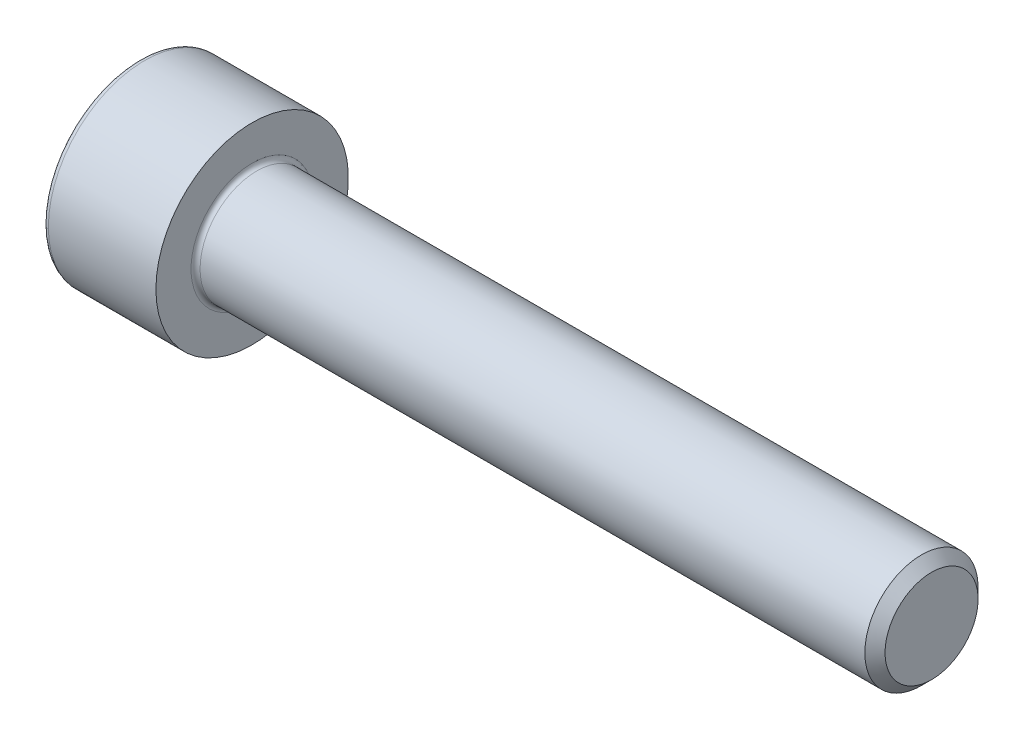
ISO-10303-21;
HEADER;
FILE_DESCRIPTION(('STEP AP214'),'2;1');
FILE_NAME('part.step','',(''),(''),'','','');
FILE_SCHEMA(('AUTOMOTIVE_DESIGN { 1 0 10303 214 1 1 1 1 }'));
ENDSEC;
DATA;
#1=APPLICATION_CONTEXT('core data for automotive mechanical design processes');
#2=APPLICATION_PROTOCOL_DEFINITION('international standard','automotive_design',2000,#1);
#3=PRODUCT_CONTEXT('',#1,'mechanical');
#4=PRODUCT('Part','Part','',(#3));
#5=PRODUCT_RELATED_PRODUCT_CATEGORY('part','',(#4));
#6=PRODUCT_DEFINITION_FORMATION('','',#4);
#7=PRODUCT_DEFINITION_CONTEXT('part definition',#1,'design');
#8=PRODUCT_DEFINITION('design','',#6,#7);
#9=PRODUCT_DEFINITION_SHAPE('','',#8);
#10=(LENGTH_UNIT() NAMED_UNIT(*) SI_UNIT(.MILLI.,.METRE.));
#11=(NAMED_UNIT(*) PLANE_ANGLE_UNIT() SI_UNIT($,.RADIAN.));
#12=(NAMED_UNIT(*) SI_UNIT($,.STERADIAN.) SOLID_ANGLE_UNIT());
#13=UNCERTAINTY_MEASURE_WITH_UNIT(LENGTH_MEASURE(1.E-05),#10,'distance_accuracy_value','');
#14=(GEOMETRIC_REPRESENTATION_CONTEXT(3) GLOBAL_UNCERTAINTY_ASSIGNED_CONTEXT((#13)) GLOBAL_UNIT_ASSIGNED_CONTEXT((#10,
#11,#12)) REPRESENTATION_CONTEXT('',''));
#15=CARTESIAN_POINT('',(0.,0.,0.));
#16=DIRECTION('',(0.,0.,1.));
#17=DIRECTION('',(1.,0.,0.));
#18=AXIS2_PLACEMENT_3D('',#15,#16,#17);
#19=CARTESIAN_POINT('',(0.,0.,0.));
#20=DIRECTION('',(-1.,0.,0.));
#21=DIRECTION('',(0.,0.,1.));
#22=AXIS2_PLACEMENT_3D('',#19,#20,#21);
#23=PLANE('',#22);
#24=DIRECTION('',(0.,-0.499999999999999,0.866025403784439));
#25=VECTOR('',#24,1.);
#26=CARTESIAN_POINT('',(0.,2.35789849937043,0.));
#27=LINE('',#26,#25);
#28=CARTESIAN_POINT('',(0.,2.35789849937043,0.));
#29=VERTEX_POINT('',#28);
#30=CARTESIAN_POINT('',(0.,1.17894924968522,2.042));
#31=VERTEX_POINT('',#30);
#32=EDGE_CURVE('E269',#29,#31,#27,.T.);
#33=ORIENTED_EDGE('',*,*,#32,.T.);
#34=DIRECTION('',(0.,1.,0.));
#35=VECTOR('',#34,1.);
#36=CARTESIAN_POINT('',(0.,-1.17894924968521,2.042));
#37=LINE('',#36,#35);
#38=CARTESIAN_POINT('',(0.,-1.17894924968521,2.042));
#39=VERTEX_POINT('',#38);
#40=EDGE_CURVE('E141',#39,#31,#37,.T.);
#41=ORIENTED_EDGE('',*,*,#40,.F.);
#42=DIRECTION('',(0.,-0.500000000000001,-0.866025403784438));
#43=VECTOR('',#42,1.);
#44=CARTESIAN_POINT('',(0.,-1.17894924968521,2.042));
#45=LINE('',#44,#43);
#46=CARTESIAN_POINT('',(0.,-2.35789849937043,0.));
#47=VERTEX_POINT('',#46);
#48=EDGE_CURVE('E272',#39,#47,#45,.T.);
#49=ORIENTED_EDGE('',*,*,#48,.T.);
#50=DIRECTION('',(0.,0.499999999999998,-0.86602540378444));
#51=VECTOR('',#50,1.);
#52=CARTESIAN_POINT('',(0.,-2.35789849937043,0.));
#53=LINE('',#52,#51);
#54=CARTESIAN_POINT('',(0.,-1.17894924968522,-2.042));
#55=VERTEX_POINT('',#54);
#56=EDGE_CURVE('E275',#47,#55,#53,.T.);
#57=ORIENTED_EDGE('',*,*,#56,.T.);
#58=DIRECTION('',(0.,-1.,0.));
#59=VECTOR('',#58,1.);
#60=CARTESIAN_POINT('',(0.,1.17894924968521,-2.042));
#61=LINE('',#60,#59);
#62=CARTESIAN_POINT('',(0.,1.17894924968521,-2.042));
#63=VERTEX_POINT('',#62);
#64=EDGE_CURVE('E278',#63,#55,#61,.T.);
#65=ORIENTED_EDGE('',*,*,#64,.F.);
#66=DIRECTION('',(0.,-0.500000000000001,-0.866025403784438));
#67=VECTOR('',#66,1.);
#68=CARTESIAN_POINT('',(0.,2.35789849937043,0.));
#69=LINE('',#68,#67);
#70=EDGE_CURVE('E136',#29,#63,#69,.T.);
#71=ORIENTED_EDGE('',*,*,#70,.F.);
#72=EDGE_LOOP('',(#33,#41,#49,#57,#65,#71));
#73=FACE_BOUND('',#72,.T.);
#74=CARTESIAN_POINT('',(0.,0.,0.));
#75=DIRECTION('',(-1.,0.,0.));
#76=DIRECTION('',(0.,0.,1.));
#77=AXIS2_PLACEMENT_3D('',#74,#75,#76);
#78=CIRCLE('',#77,4.);
#79=CARTESIAN_POINT('',(0.,0.,4.));
#80=VERTEX_POINT('',#79);
#81=EDGE_CURVE('E53',#80,#80,#78,.T.);
#82=ORIENTED_EDGE('',*,*,#81,.T.);
#83=EDGE_LOOP('',(#82));
#84=FACE_BOUND('',#83,.T.);
#85=ADVANCED_FACE('F45',(#73,#84),#23,.T.);
#86=CARTESIAN_POINT('',(-31.75,0.,0.));
#87=DIRECTION('',(-1.,0.,0.));
#88=DIRECTION('',(0.,0.,1.));
#89=AXIS2_PLACEMENT_3D('',#86,#87,#88);
#90=CYLINDRICAL_SURFACE('',#89,4.25);
#91=CARTESIAN_POINT('',(0.25,0.,0.));
#92=DIRECTION('',(-1.,0.,0.));
#93=DIRECTION('',(0.,0.,1.));
#94=AXIS2_PLACEMENT_3D('',#91,#92,#93);
#95=CIRCLE('',#94,4.25);
#96=CARTESIAN_POINT('',(0.25,0.,4.25));
#97=VERTEX_POINT('',#96);
#98=EDGE_CURVE('E11',#97,#97,#95,.F.);
#99=ORIENTED_EDGE('',*,*,#98,.T.);
#100=EDGE_LOOP('',(#99));
#101=FACE_BOUND('',#100,.T.);
#102=CARTESIAN_POINT('',(5.,0.,0.));
#103=DIRECTION('',(-1.,0.,0.));
#104=DIRECTION('',(0.,0.,1.));
#105=AXIS2_PLACEMENT_3D('',#102,#103,#104);
#106=CIRCLE('',#105,4.25);
#107=CARTESIAN_POINT('',(5.,0.,4.25));
#108=VERTEX_POINT('',#107);
#109=EDGE_CURVE('E159',#108,#108,#106,.T.);
#110=ORIENTED_EDGE('',*,*,#109,.T.);
#111=EDGE_LOOP('',(#110));
#112=FACE_BOUND('',#111,.T.);
#113=ADVANCED_FACE('F184',(#101,#112),#90,.T.);
#114=CARTESIAN_POINT('',(5.,4.25,0.));
#115=DIRECTION('',(1.,0.,0.));
#116=DIRECTION('',(0.,0.,-1.));
#117=AXIS2_PLACEMENT_3D('',#114,#115,#116);
#118=PLANE('',#117);
#119=CARTESIAN_POINT('',(5.,0.,0.));
#120=DIRECTION('',(1.,0.,0.));
#121=DIRECTION('',(0.,0.,-1.));
#122=AXIS2_PLACEMENT_3D('',#119,#120,#121);
#123=CIRCLE('',#122,2.7);
#124=CARTESIAN_POINT('',(5.,0.,-2.7));
#125=VERTEX_POINT('',#124);
#126=EDGE_CURVE('E162',#125,#125,#123,.F.);
#127=ORIENTED_EDGE('',*,*,#126,.T.);
#128=EDGE_LOOP('',(#127));
#129=FACE_BOUND('',#128,.T.);
#130=ORIENTED_EDGE('',*,*,#109,.F.);
#131=EDGE_LOOP('',(#130));
#132=FACE_BOUND('',#131,.T.);
#133=ADVANCED_FACE('F189',(#129,#132),#118,.T.);
#134=CARTESIAN_POINT('',(-31.75,0.,0.));
#135=DIRECTION('',(-1.,0.,0.));
#136=DIRECTION('',(0.,0.,1.));
#137=AXIS2_PLACEMENT_3D('',#134,#135,#136);
#138=CYLINDRICAL_SURFACE('',#137,2.5);
#139=CARTESIAN_POINT('',(5.2,0.,0.));
#140=DIRECTION('',(1.,0.,0.));
#141=DIRECTION('',(0.,0.,-1.));
#142=AXIS2_PLACEMENT_3D('',#139,#140,#141);
#143=CIRCLE('',#142,2.5);
#144=CARTESIAN_POINT('',(5.2,0.,-2.5));
#145=VERTEX_POINT('',#144);
#146=EDGE_CURVE('E165',#145,#145,#143,.T.);
#147=ORIENTED_EDGE('',*,*,#146,.T.);
#148=EDGE_LOOP('',(#147));
#149=FACE_BOUND('',#148,.T.);
#150=CARTESIAN_POINT('',(34.555,0.,0.));
#151=DIRECTION('',(-1.,0.,0.));
#152=DIRECTION('',(0.,0.,1.));
#153=AXIS2_PLACEMENT_3D('',#150,#151,#152);
#154=CIRCLE('',#153,2.5);
#155=CARTESIAN_POINT('',(34.555,0.,2.5));
#156=VERTEX_POINT('',#155);
#157=EDGE_CURVE('E156',#156,#156,#154,.T.);
#158=ORIENTED_EDGE('',*,*,#157,.T.);
#159=EDGE_LOOP('',(#158));
#160=FACE_BOUND('',#159,.T.);
#161=ADVANCED_FACE('F195',(#149,#160),#138,.T.);
#162=CARTESIAN_POINT('',(35.,0.,0.));
#163=DIRECTION('',(-1.,0.,0.));
#164=DIRECTION('',(0.,0.,1.));
#165=AXIS2_PLACEMENT_3D('',#162,#163,#164);
#166=CONICAL_SURFACE('',#165,2.055,0.785398163397479);
#167=ORIENTED_EDGE('',*,*,#157,.F.);
#168=EDGE_LOOP('',(#167));
#169=FACE_BOUND('',#168,.T.);
#170=CARTESIAN_POINT('',(35.,0.,0.));
#171=DIRECTION('',(-1.,0.,0.));
#172=DIRECTION('',(0.,0.,1.));
#173=AXIS2_PLACEMENT_3D('',#170,#171,#172);
#174=CIRCLE('',#173,2.055);
#175=CARTESIAN_POINT('',(35.,0.,2.055));
#176=VERTEX_POINT('',#175);
#177=EDGE_CURVE('E152',#176,#176,#174,.T.);
#178=ORIENTED_EDGE('',*,*,#177,.T.);
#179=EDGE_LOOP('',(#178));
#180=FACE_BOUND('',#179,.T.);
#181=ADVANCED_FACE('F199',(#169,#180),#166,.T.);
#182=CARTESIAN_POINT('',(35.,2.055,0.));
#183=DIRECTION('',(1.,0.,0.));
#184=DIRECTION('',(0.,0.,-1.));
#185=AXIS2_PLACEMENT_3D('',#182,#183,#184);
#186=PLANE('',#185);
#187=ORIENTED_EDGE('',*,*,#177,.F.);
#188=EDGE_LOOP('',(#187));
#189=FACE_BOUND('',#188,.T.);
#190=ADVANCED_FACE('F181',(#189),#186,.T.);
#191=CARTESIAN_POINT('',(5.2,0.,0.));
#192=DIRECTION('',(1.,0.,0.));
#193=DIRECTION('',(0.,0.,-1.));
#194=AXIS2_PLACEMENT_3D('',#191,#192,#193);
#195=TOROIDAL_SURFACE('',#194,2.7,0.2);
#196=ORIENTED_EDGE('',*,*,#146,.F.);
#197=EDGE_LOOP('',(#196));
#198=FACE_BOUND('',#197,.T.);
#199=ORIENTED_EDGE('',*,*,#126,.F.);
#200=EDGE_LOOP('',(#199));
#201=FACE_BOUND('',#200,.T.);
#202=ADVANCED_FACE('F172',(#198,#201),#195,.F.);
#203=CARTESIAN_POINT('',(0.25,0.,0.));
#204=DIRECTION('',(-1.,0.,0.));
#205=DIRECTION('',(0.,0.,1.));
#206=AXIS2_PLACEMENT_3D('',#203,#204,#205);
#207=TOROIDAL_SURFACE('',#206,4.,0.25);
#208=ORIENTED_EDGE('',*,*,#98,.F.);
#209=EDGE_LOOP('',(#208));
#210=FACE_BOUND('',#209,.T.);
#211=ORIENTED_EDGE('',*,*,#81,.F.);
#212=EDGE_LOOP('',(#211));
#213=FACE_BOUND('',#212,.T.);
#214=ADVANCED_FACE('F47',(#210,#213),#207,.T.);
#215=CARTESIAN_POINT('',(2.5,2.35789849937043,0.));
#216=DIRECTION('',(0.,-0.866025403784439,-0.499999999999999));
#217=DIRECTION('',(0.,0.499999999999999,-0.866025403784439));
#218=AXIS2_PLACEMENT_3D('',#215,#216,#217);
#219=PLANE('',#218);
#220=ORIENTED_EDGE('',*,*,#32,.F.);
#221=DIRECTION('',(-1.,0.,0.));
#222=VECTOR('',#221,1.);
#223=CARTESIAN_POINT('',(2.5,2.35789849937043,0.));
#224=LINE('',#223,#222);
#225=CARTESIAN_POINT('',(2.5,2.35789849937043,0.));
#226=VERTEX_POINT('',#225);
#227=EDGE_CURVE('E259',#226,#29,#224,.T.);
#228=ORIENTED_EDGE('',*,*,#227,.F.);
#229=DIRECTION('',(0.,-0.499999999999999,0.866025403784439));
#230=VECTOR('',#229,1.);
#231=CARTESIAN_POINT('',(2.5,2.35789849937043,0.));
#232=LINE('',#231,#230);
#233=CARTESIAN_POINT('',(2.5,1.76842387452783,1.021));
#234=VERTEX_POINT('',#233);
#235=EDGE_CURVE('E128',#226,#234,#232,.T.);
#236=ORIENTED_EDGE('',*,*,#235,.T.);
#237=CARTESIAN_POINT('',(2.5,1.17894924968522,2.042));
#238=VERTEX_POINT('',#237);
#239=EDGE_CURVE('E119',#234,#238,#232,.T.);
#240=ORIENTED_EDGE('',*,*,#239,.T.);
#241=DIRECTION('',(-1.,0.,0.));
#242=VECTOR('',#241,1.);
#243=CARTESIAN_POINT('',(2.5,1.17894924968522,2.042));
#244=LINE('',#243,#242);
#245=EDGE_CURVE('E133',#238,#31,#244,.T.);
#246=ORIENTED_EDGE('',*,*,#245,.T.);
#247=EDGE_LOOP('',(#220,#228,#236,#240,#246));
#248=FACE_BOUND('',#247,.T.);
#249=ADVANCED_FACE('F132',(#248),#219,.T.);
#250=CARTESIAN_POINT('',(2.5,-1.17894924968521,2.042));
#251=DIRECTION('',(0.,0.,1.));
#252=DIRECTION('',(0.,-1.,0.));
#253=AXIS2_PLACEMENT_3D('',#250,#251,#252);
#254=PLANE('',#253);
#255=ORIENTED_EDGE('',*,*,#40,.T.);
#256=ORIENTED_EDGE('',*,*,#245,.F.);
#257=DIRECTION('',(0.,1.,0.));
#258=VECTOR('',#257,1.);
#259=CARTESIAN_POINT('',(2.5,-1.17894924968521,2.042));
#260=LINE('',#259,#258);
#261=CARTESIAN_POINT('',(2.5,0.,2.042));
#262=VERTEX_POINT('',#261);
#263=EDGE_CURVE('E116',#262,#238,#260,.T.);
#264=ORIENTED_EDGE('',*,*,#263,.F.);
#265=CARTESIAN_POINT('',(2.5,-1.17894924968521,2.042));
#266=VERTEX_POINT('',#265);
#267=EDGE_CURVE('E127',#266,#262,#260,.T.);
#268=ORIENTED_EDGE('',*,*,#267,.F.);
#269=DIRECTION('',(-1.,0.,0.));
#270=VECTOR('',#269,1.);
#271=CARTESIAN_POINT('',(2.5,-1.17894924968521,2.042));
#272=LINE('',#271,#270);
#273=EDGE_CURVE('E143',#266,#39,#272,.T.);
#274=ORIENTED_EDGE('',*,*,#273,.T.);
#275=EDGE_LOOP('',(#255,#256,#264,#268,#274));
#276=FACE_BOUND('',#275,.T.);
#277=ADVANCED_FACE('F138',(#276),#254,.F.);
#278=CARTESIAN_POINT('',(2.5,-1.17894924968521,2.042));
#279=DIRECTION('',(0.,0.866025403784438,-0.500000000000001));
#280=DIRECTION('',(0.,0.500000000000001,0.866025403784438));
#281=AXIS2_PLACEMENT_3D('',#278,#279,#280);
#282=PLANE('',#281);
#283=ORIENTED_EDGE('',*,*,#48,.F.);
#284=ORIENTED_EDGE('',*,*,#273,.F.);
#285=DIRECTION('',(0.,-0.500000000000001,-0.866025403784438));
#286=VECTOR('',#285,1.);
#287=CARTESIAN_POINT('',(2.5,-1.17894924968521,2.042));
#288=LINE('',#287,#286);
#289=CARTESIAN_POINT('',(2.5,-1.76842387452782,1.021));
#290=VERTEX_POINT('',#289);
#291=EDGE_CURVE('E298',#266,#290,#288,.T.);
#292=ORIENTED_EDGE('',*,*,#291,.T.);
#293=CARTESIAN_POINT('',(2.5,-2.35789849937043,0.));
#294=VERTEX_POINT('',#293);
#295=EDGE_CURVE('E287',#290,#294,#288,.T.);
#296=ORIENTED_EDGE('',*,*,#295,.T.);
#297=DIRECTION('',(-1.,0.,0.));
#298=VECTOR('',#297,1.);
#299=CARTESIAN_POINT('',(2.5,-2.35789849937043,0.));
#300=LINE('',#299,#298);
#301=EDGE_CURVE('E148',#294,#47,#300,.T.);
#302=ORIENTED_EDGE('',*,*,#301,.T.);
#303=EDGE_LOOP('',(#283,#284,#292,#296,#302));
#304=FACE_BOUND('',#303,.T.);
#305=ADVANCED_FACE('F213',(#304),#282,.T.);
#306=CARTESIAN_POINT('',(2.5,-2.35789849937043,0.));
#307=DIRECTION('',(0.,0.86602540378444,0.499999999999998));
#308=DIRECTION('',(0.,-0.499999999999998,0.86602540378444));
#309=AXIS2_PLACEMENT_3D('',#306,#307,#308);
#310=PLANE('',#309);
#311=ORIENTED_EDGE('',*,*,#56,.F.);
#312=ORIENTED_EDGE('',*,*,#301,.F.);
#313=DIRECTION('',(0.,0.499999999999998,-0.86602540378444));
#314=VECTOR('',#313,1.);
#315=CARTESIAN_POINT('',(2.5,-2.35789849937043,0.));
#316=LINE('',#315,#314);
#317=CARTESIAN_POINT('',(2.5,-1.76842387452782,-1.021));
#318=VERTEX_POINT('',#317);
#319=EDGE_CURVE('E265',#294,#318,#316,.T.);
#320=ORIENTED_EDGE('',*,*,#319,.T.);
#321=CARTESIAN_POINT('',(2.5,-1.17894924968522,-2.042));
#322=VERTEX_POINT('',#321);
#323=EDGE_CURVE('E297',#318,#322,#316,.T.);
#324=ORIENTED_EDGE('',*,*,#323,.T.);
#325=DIRECTION('',(-1.,0.,0.));
#326=VECTOR('',#325,1.);
#327=CARTESIAN_POINT('',(2.5,-1.17894924968522,-2.042));
#328=LINE('',#327,#326);
#329=EDGE_CURVE('E258',#322,#55,#328,.T.);
#330=ORIENTED_EDGE('',*,*,#329,.T.);
#331=EDGE_LOOP('',(#311,#312,#320,#324,#330));
#332=FACE_BOUND('',#331,.T.);
#333=ADVANCED_FACE('F216',(#332),#310,.T.);
#334=CARTESIAN_POINT('',(2.5,1.17894924968521,-2.042));
#335=DIRECTION('',(0.,0.,-1.));
#336=DIRECTION('',(0.,1.,0.));
#337=AXIS2_PLACEMENT_3D('',#334,#335,#336);
#338=PLANE('',#337);
#339=ORIENTED_EDGE('',*,*,#64,.T.);
#340=ORIENTED_EDGE('',*,*,#329,.F.);
#341=DIRECTION('',(0.,-1.,0.));
#342=VECTOR('',#341,1.);
#343=CARTESIAN_POINT('',(2.5,1.17894924968521,-2.042));
#344=LINE('',#343,#342);
#345=CARTESIAN_POINT('',(2.5,0.,-2.042));
#346=VERTEX_POINT('',#345);
#347=EDGE_CURVE('E262',#346,#322,#344,.T.);
#348=ORIENTED_EDGE('',*,*,#347,.F.);
#349=CARTESIAN_POINT('',(2.5,1.17894924968521,-2.042));
#350=VERTEX_POINT('',#349);
#351=EDGE_CURVE('E60',#350,#346,#344,.T.);
#352=ORIENTED_EDGE('',*,*,#351,.F.);
#353=DIRECTION('',(-1.,0.,0.));
#354=VECTOR('',#353,1.);
#355=CARTESIAN_POINT('',(2.5,1.17894924968521,-2.042));
#356=LINE('',#355,#354);
#357=EDGE_CURVE('E255',#350,#63,#356,.T.);
#358=ORIENTED_EDGE('',*,*,#357,.T.);
#359=EDGE_LOOP('',(#339,#340,#348,#352,#358));
#360=FACE_BOUND('',#359,.T.);
#361=ADVANCED_FACE('F220',(#360),#338,.F.);
#362=CARTESIAN_POINT('',(2.5,2.35789849937043,0.));
#363=DIRECTION('',(0.,0.866025403784438,-0.500000000000001));
#364=DIRECTION('',(0.,0.500000000000001,0.866025403784438));
#365=AXIS2_PLACEMENT_3D('',#362,#363,#364);
#366=PLANE('',#365);
#367=ORIENTED_EDGE('',*,*,#70,.T.);
#368=ORIENTED_EDGE('',*,*,#357,.F.);
#369=DIRECTION('',(0.,-0.500000000000001,-0.866025403784438));
#370=VECTOR('',#369,1.);
#371=CARTESIAN_POINT('',(2.5,2.35789849937043,0.));
#372=LINE('',#371,#370);
#373=CARTESIAN_POINT('',(2.5,1.76842387452782,-1.021));
#374=VERTEX_POINT('',#373);
#375=EDGE_CURVE('E245',#374,#350,#372,.T.);
#376=ORIENTED_EDGE('',*,*,#375,.F.);
#377=EDGE_CURVE('E251',#226,#374,#372,.T.);
#378=ORIENTED_EDGE('',*,*,#377,.F.);
#379=ORIENTED_EDGE('',*,*,#227,.T.);
#380=EDGE_LOOP('',(#367,#368,#376,#378,#379));
#381=FACE_BOUND('',#380,.T.);
#382=ADVANCED_FACE('F224',(#381),#366,.F.);
#383=CARTESIAN_POINT('',(2.5,3.53684774905564,-2.042));
#384=DIRECTION('',(1.,0.,0.));
#385=DIRECTION('',(0.,0.,-1.));
#386=AXIS2_PLACEMENT_3D('',#383,#384,#385);
#387=PLANE('',#386);
#388=ORIENTED_EDGE('',*,*,#347,.T.);
#389=ORIENTED_EDGE('',*,*,#323,.F.);
#390=CARTESIAN_POINT('',(2.5,0.,0.));
#391=DIRECTION('',(-1.,0.,0.));
#392=DIRECTION('',(0.,0.,1.));
#393=AXIS2_PLACEMENT_3D('',#390,#391,#392);
#394=CIRCLE('',#393,2.042);
#395=EDGE_CURVE('E293',#346,#318,#394,.T.);
#396=ORIENTED_EDGE('',*,*,#395,.F.);
#397=EDGE_LOOP('',(#388,#389,#396));
#398=FACE_BOUND('',#397,.T.);
#399=ADVANCED_FACE('F228',(#398),#387,.F.);
#400=ORIENTED_EDGE('',*,*,#319,.F.);
#401=ORIENTED_EDGE('',*,*,#295,.F.);
#402=EDGE_CURVE('E146',#318,#290,#394,.T.);
#403=ORIENTED_EDGE('',*,*,#402,.F.);
#404=EDGE_LOOP('',(#400,#401,#403));
#405=FACE_BOUND('',#404,.T.);
#406=ADVANCED_FACE('F231',(#405),#387,.F.);
#407=ORIENTED_EDGE('',*,*,#291,.F.);
#408=ORIENTED_EDGE('',*,*,#267,.T.);
#409=EDGE_CURVE('E142',#290,#262,#394,.T.);
#410=ORIENTED_EDGE('',*,*,#409,.F.);
#411=EDGE_LOOP('',(#407,#408,#410));
#412=FACE_BOUND('',#411,.T.);
#413=ADVANCED_FACE('F236',(#412),#387,.F.);
#414=ORIENTED_EDGE('',*,*,#263,.T.);
#415=ORIENTED_EDGE('',*,*,#239,.F.);
#416=EDGE_CURVE('E122',#262,#234,#394,.T.);
#417=ORIENTED_EDGE('',*,*,#416,.F.);
#418=EDGE_LOOP('',(#414,#415,#417));
#419=FACE_BOUND('',#418,.T.);
#420=ADVANCED_FACE('F118',(#419),#387,.F.);
#421=ORIENTED_EDGE('',*,*,#235,.F.);
#422=ORIENTED_EDGE('',*,*,#377,.T.);
#423=EDGE_CURVE('E153',#234,#374,#394,.T.);
#424=ORIENTED_EDGE('',*,*,#423,.F.);
#425=EDGE_LOOP('',(#421,#422,#424));
#426=FACE_BOUND('',#425,.T.);
#427=ADVANCED_FACE('F239',(#426),#387,.F.);
#428=ORIENTED_EDGE('',*,*,#375,.T.);
#429=ORIENTED_EDGE('',*,*,#351,.T.);
#430=EDGE_CURVE('E248',#374,#346,#394,.T.);
#431=ORIENTED_EDGE('',*,*,#430,.F.);
#432=EDGE_LOOP('',(#428,#429,#431));
#433=FACE_BOUND('',#432,.T.);
#434=ADVANCED_FACE('F209',(#433),#387,.F.);
#435=CARTESIAN_POINT('',(2.5,0.,0.));
#436=DIRECTION('',(-1.,0.,0.));
#437=DIRECTION('',(0.,0.,1.));
#438=AXIS2_PLACEMENT_3D('',#435,#436,#437);
#439=CONICAL_SURFACE('',#438,2.042,1.04719755119659);
#440=CARTESIAN_POINT('',(3.67894924968523,0.,0.));
#441=VERTEX_POINT('',#440);
#442=VERTEX_LOOP('',#441);
#443=FACE_BOUND('',#442,.T.);
#444=ORIENTED_EDGE('',*,*,#416,.T.);
#445=ORIENTED_EDGE('',*,*,#423,.T.);
#446=ORIENTED_EDGE('',*,*,#430,.T.);
#447=ORIENTED_EDGE('',*,*,#395,.T.);
#448=ORIENTED_EDGE('',*,*,#402,.T.);
#449=ORIENTED_EDGE('',*,*,#409,.T.);
#450=EDGE_LOOP('',(#444,#445,#446,#447,#448,#449));
#451=FACE_BOUND('',#450,.T.);
#452=ADVANCED_FACE('F207',(#443,#451),#439,.F.);
#453=CLOSED_SHELL('',(#85,#113,#133,#161,#181,#190,#202,#214,#249,#277,#305,#333,#361,#382,#399,
#406,#413,#420,#427,#434,#452));
#454=MANIFOLD_SOLID_BREP('B2',#453);
#455=ADVANCED_BREP_SHAPE_REPRESENTATION('',(#18,#454),#14);
#456=SHAPE_DEFINITION_REPRESENTATION(#9,#455);
ENDSEC;
END-ISO-10303-21;
